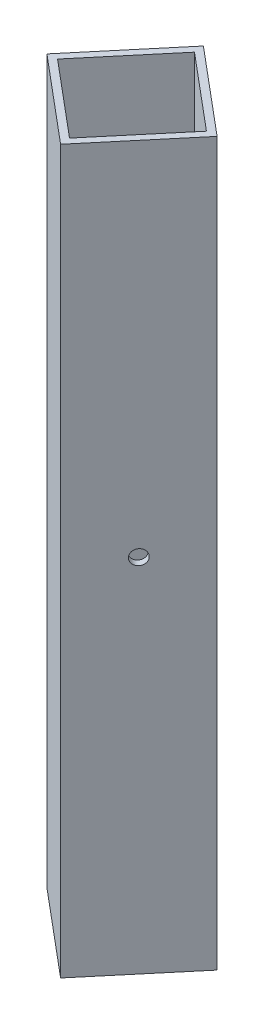
ISO-10303-21;
HEADER;
FILE_DESCRIPTION(('STEP AP214'),'2;1');
FILE_NAME('part.step','',(''),(''),'','','');
FILE_SCHEMA(('AUTOMOTIVE_DESIGN { 1 0 10303 214 1 1 1 1 }'));
ENDSEC;
DATA;
#1=APPLICATION_CONTEXT('core data for automotive mechanical design processes');
#2=APPLICATION_PROTOCOL_DEFINITION('international standard','automotive_design',2000,#1);
#3=PRODUCT_CONTEXT('',#1,'mechanical');
#4=PRODUCT('Part','Part','',(#3));
#5=PRODUCT_RELATED_PRODUCT_CATEGORY('part','',(#4));
#6=PRODUCT_DEFINITION_FORMATION('','',#4);
#7=PRODUCT_DEFINITION_CONTEXT('part definition',#1,'design');
#8=PRODUCT_DEFINITION('design','',#6,#7);
#9=PRODUCT_DEFINITION_SHAPE('','',#8);
#10=(LENGTH_UNIT() NAMED_UNIT(*) SI_UNIT(.MILLI.,.METRE.));
#11=(NAMED_UNIT(*) PLANE_ANGLE_UNIT() SI_UNIT($,.RADIAN.));
#12=(NAMED_UNIT(*) SI_UNIT($,.STERADIAN.) SOLID_ANGLE_UNIT());
#13=UNCERTAINTY_MEASURE_WITH_UNIT(LENGTH_MEASURE(1.E-05),#10,'distance_accuracy_value','');
#14=(GEOMETRIC_REPRESENTATION_CONTEXT(3) GLOBAL_UNCERTAINTY_ASSIGNED_CONTEXT((#13)) GLOBAL_UNIT_ASSIGNED_CONTEXT((#10,
#11,#12)) REPRESENTATION_CONTEXT('',''));
#15=CARTESIAN_POINT('',(0.,0.,0.));
#16=DIRECTION('',(0.,0.,1.));
#17=DIRECTION('',(1.,0.,0.));
#18=AXIS2_PLACEMENT_3D('',#15,#16,#17);
#19=CARTESIAN_POINT('',(360.587988116179,165.1,295.999551887389));
#20=DIRECTION('',(0.64278760968654,0.,-0.766044443118978));
#21=DIRECTION('',(-0.766044443118978,0.,-0.64278760968654));
#22=AXIS2_PLACEMENT_3D('',#19,#20,#21);
#23=PLANE('',#22);
#24=DIRECTION('',(0.766044443118978,0.,0.64278760968654));
#25=VECTOR('',#24,1.);
#26=CARTESIAN_POINT('',(360.587988116179,-165.1,295.999551887389));
#27=LINE('',#26,#25);
#28=CARTESIAN_POINT('',(987.787862844886,-165.1,822.282735446684));
#29=VERTEX_POINT('',#28);
#30=CARTESIAN_POINT('',(1026.70292055533,-165.1,854.93634601876));
#31=VERTEX_POINT('',#30);
#32=EDGE_CURVE('E163',#29,#31,#27,.T.);
#33=ORIENTED_EDGE('',*,*,#32,.F.);
#34=DIRECTION('',(0.,-1.,0.));
#35=VECTOR('',#34,1.);
#36=CARTESIAN_POINT('',(987.787862844886,165.1,822.282735446684));
#37=LINE('',#36,#35);
#38=CARTESIAN_POINT('',(987.787862844886,165.1,822.282735446684));
#39=VERTEX_POINT('',#38);
#40=EDGE_CURVE('E11',#39,#29,#37,.T.);
#41=ORIENTED_EDGE('',*,*,#40,.F.);
#42=DIRECTION('',(0.766044443118978,0.,0.64278760968654));
#43=VECTOR('',#42,1.);
#44=CARTESIAN_POINT('',(360.587988116179,165.1,295.999551887389));
#45=LINE('',#44,#43);
#46=CARTESIAN_POINT('',(1026.70292055533,165.1,854.93634601876));
#47=VERTEX_POINT('',#46);
#48=EDGE_CURVE('E121',#39,#47,#45,.T.);
#49=ORIENTED_EDGE('',*,*,#48,.T.);
#50=DIRECTION('',(0.,-1.,0.));
#51=VECTOR('',#50,1.);
#52=CARTESIAN_POINT('',(1026.70292055533,165.1,854.93634601876));
#53=LINE('',#52,#51);
#54=EDGE_CURVE('E88',#47,#31,#53,.T.);
#55=ORIENTED_EDGE('',*,*,#54,.T.);
#56=EDGE_LOOP('',(#33,#41,#49,#55));
#57=FACE_BOUND('',#56,.T.);
#58=ADVANCED_FACE('F16',(#57),#23,.T.);
#59=CARTESIAN_POINT('',(965.570417164201,165.1,848.760456154906));
#60=DIRECTION('',(0.766044443118978,0.,0.64278760968654));
#61=DIRECTION('',(0.64278760968654,0.,-0.766044443118978));
#62=AXIS2_PLACEMENT_3D('',#59,#60,#61);
#63=PLANE('',#62);
#64=CARTESIAN_POINT('',(971.461057558848,0.,841.740264301906));
#65=DIRECTION('',(-0.766044443118978,0.,-0.64278760968654));
#66=DIRECTION('',(-0.64278760968654,0.,0.766044443118978));
#67=AXIS2_PLACEMENT_3D('',#64,#65,#66);
#68=CIRCLE('',#67,3.37820000000011);
#69=CARTESIAN_POINT('',(969.289592455805,0.,844.328115639651));
#70=VERTEX_POINT('',#69);
#71=EDGE_CURVE('E264',#70,#70,#68,.T.);
#72=ORIENTED_EDGE('',*,*,#71,.F.);
#73=EDGE_LOOP('',(#72));
#74=FACE_BOUND('',#73,.T.);
#75=DIRECTION('',(-0.64278760968654,0.,0.766044443118978));
#76=VECTOR('',#75,1.);
#77=CARTESIAN_POINT('',(965.570417164201,-165.1,848.760456154906));
#78=LINE('',#77,#76);
#79=CARTESIAN_POINT('',(955.134252272809,-165.1,861.197793157127));
#80=VERTEX_POINT('',#79);
#81=EDGE_CURVE('E128',#29,#80,#78,.T.);
#82=ORIENTED_EDGE('',*,*,#81,.T.);
#83=DIRECTION('',(0.,-1.,0.));
#84=VECTOR('',#83,1.);
#85=CARTESIAN_POINT('',(955.134252272809,165.1,861.197793157127));
#86=LINE('',#85,#84);
#87=CARTESIAN_POINT('',(955.134252272809,165.1,861.197793157127));
#88=VERTEX_POINT('',#87);
#89=EDGE_CURVE('E27',#88,#80,#86,.T.);
#90=ORIENTED_EDGE('',*,*,#89,.F.);
#91=DIRECTION('',(-0.64278760968654,0.,0.766044443118978));
#92=VECTOR('',#91,1.);
#93=CARTESIAN_POINT('',(965.570417164201,165.1,848.760456154906));
#94=LINE('',#93,#92);
#95=EDGE_CURVE('E116',#39,#88,#94,.T.);
#96=ORIENTED_EDGE('',*,*,#95,.F.);
#97=ORIENTED_EDGE('',*,*,#40,.T.);
#98=EDGE_LOOP('',(#82,#90,#96,#97));
#99=FACE_BOUND('',#98,.T.);
#100=ADVANCED_FACE('F126',(#74,#99),#63,.F.);
#101=CARTESIAN_POINT('',(278.112903575089,165.1,293.109429165724));
#102=DIRECTION('',(-0.64278760968654,0.,0.766044443118978));
#103=DIRECTION('',(0.766044443118978,0.,0.64278760968654));
#104=AXIS2_PLACEMENT_3D('',#101,#102,#103);
#105=PLANE('',#104);
#106=DIRECTION('',(-0.766044443118978,0.,-0.64278760968654));
#107=VECTOR('',#106,1.);
#108=CARTESIAN_POINT('',(278.112903575089,-165.1,293.109429165724));
#109=LINE('',#108,#107);
#110=CARTESIAN_POINT('',(994.049309983253,-165.1,893.851403729204));
#111=VERTEX_POINT('',#110);
#112=EDGE_CURVE('E169',#111,#80,#109,.T.);
#113=ORIENTED_EDGE('',*,*,#112,.F.);
#114=DIRECTION('',(0.,-1.,0.));
#115=VECTOR('',#114,1.);
#116=CARTESIAN_POINT('',(994.049309983253,165.1,893.851403729204));
#117=LINE('',#116,#115);
#118=CARTESIAN_POINT('',(994.049309983253,165.1,893.851403729204));
#119=VERTEX_POINT('',#118);
#120=EDGE_CURVE('E78',#119,#111,#117,.T.);
#121=ORIENTED_EDGE('',*,*,#120,.F.);
#122=DIRECTION('',(-0.766044443118978,0.,-0.64278760968654));
#123=VECTOR('',#122,1.);
#124=CARTESIAN_POINT('',(278.112903575089,165.1,293.109429165724));
#125=LINE('',#124,#123);
#126=EDGE_CURVE('E120',#119,#88,#125,.T.);
#127=ORIENTED_EDGE('',*,*,#126,.T.);
#128=ORIENTED_EDGE('',*,*,#89,.T.);
#129=EDGE_LOOP('',(#113,#121,#127,#128));
#130=FACE_BOUND('',#129,.T.);
#131=ADVANCED_FACE('F134',(#130),#105,.T.);
#132=CARTESIAN_POINT('',(1002.44079281438,165.1,878.911400767734));
#133=DIRECTION('',(-0.766044443118978,0.,-0.64278760968654));
#134=DIRECTION('',(-0.64278760968654,0.,0.766044443118978));
#135=AXIS2_PLACEMENT_3D('',#132,#133,#134);
#136=PLANE('',#135);
#137=CARTESIAN_POINT('',(1007.94392416239,0.,872.353024213227));
#138=DIRECTION('',(-0.766044443118978,0.,-0.64278760968654));
#139=DIRECTION('',(-0.64278760968654,0.,0.766044443118978));
#140=AXIS2_PLACEMENT_3D('',#137,#138,#139);
#141=CIRCLE('',#140,3.3782);
#142=CARTESIAN_POINT('',(1005.77245905935,0.,874.940875550972));
#143=VERTEX_POINT('',#142);
#144=EDGE_CURVE('E151',#143,#143,#141,.F.);
#145=ORIENTED_EDGE('',*,*,#144,.T.);
#146=EDGE_LOOP('',(#145));
#147=FACE_BOUND('',#146,.T.);
#148=DIRECTION('',(0.64278760968654,0.,-0.766044443118978));
#149=VECTOR('',#148,1.);
#150=CARTESIAN_POINT('',(1002.44079281438,-165.1,878.911400767734));
#151=LINE('',#150,#149);
#152=CARTESIAN_POINT('',(993.657969537106,-165.1,889.378361961546));
#153=VERTEX_POINT('',#152);
#154=CARTESIAN_POINT('',(1022.22987878767,-165.1,855.327686464908));
#155=VERTEX_POINT('',#154);
#156=EDGE_CURVE('E146',#153,#155,#151,.T.);
#157=ORIENTED_EDGE('',*,*,#156,.F.);
#158=DIRECTION('',(0.,-1.,0.));
#159=VECTOR('',#158,1.);
#160=CARTESIAN_POINT('',(993.657969537106,165.1,889.378361961546));
#161=LINE('',#160,#159);
#162=CARTESIAN_POINT('',(993.657969537106,165.1,889.378361961546));
#163=VERTEX_POINT('',#162);
#164=EDGE_CURVE('E98',#163,#153,#161,.T.);
#165=ORIENTED_EDGE('',*,*,#164,.F.);
#166=DIRECTION('',(0.64278760968654,0.,-0.766044443118978));
#167=VECTOR('',#166,1.);
#168=CARTESIAN_POINT('',(1002.44079281438,165.1,878.911400767734));
#169=LINE('',#168,#167);
#170=CARTESIAN_POINT('',(1022.22987878767,165.1,855.327686464908));
#171=VERTEX_POINT('',#170);
#172=EDGE_CURVE('E175',#163,#171,#169,.T.);
#173=ORIENTED_EDGE('',*,*,#172,.T.);
#174=DIRECTION('',(0.,-1.,0.));
#175=VECTOR('',#174,1.);
#176=CARTESIAN_POINT('',(1022.22987878767,165.1,855.327686464908));
#177=LINE('',#176,#175);
#178=EDGE_CURVE('E142',#171,#155,#177,.T.);
#179=ORIENTED_EDGE('',*,*,#178,.T.);
#180=EDGE_LOOP('',(#157,#165,#173,#179));
#181=FACE_BOUND('',#180,.T.);
#182=ADVANCED_FACE('F18',(#147,#181),#136,.T.);
#183=CARTESIAN_POINT('',(754.755398596091,165.1,688.915302797637));
#184=DIRECTION('',(0.64278760968654,0.,-0.766044443118978));
#185=DIRECTION('',(-0.766044443118978,0.,-0.64278760968654));
#186=AXIS2_PLACEMENT_3D('',#183,#184,#185);
#187=PLANE('',#186);
#188=DIRECTION('',(0.766044443118978,0.,0.64278760968654));
#189=VECTOR('',#188,1.);
#190=CARTESIAN_POINT('',(754.755398596091,-165.1,688.915302797637));
#191=LINE('',#190,#189);
#192=CARTESIAN_POINT('',(959.607294040467,-165.1,860.80645271098));
#193=VERTEX_POINT('',#192);
#194=EDGE_CURVE('E150',#193,#153,#191,.T.);
#195=ORIENTED_EDGE('',*,*,#194,.F.);
#196=DIRECTION('',(0.,-1.,0.));
#197=VECTOR('',#196,1.);
#198=CARTESIAN_POINT('',(959.607294040467,165.1,860.80645271098));
#199=LINE('',#198,#197);
#200=CARTESIAN_POINT('',(959.607294040467,165.1,860.80645271098));
#201=VERTEX_POINT('',#200);
#202=EDGE_CURVE('E185',#201,#193,#199,.T.);
#203=ORIENTED_EDGE('',*,*,#202,.F.);
#204=DIRECTION('',(0.766044443118978,0.,0.64278760968654));
#205=VECTOR('',#204,1.);
#206=CARTESIAN_POINT('',(754.755398596091,165.1,688.915302797637));
#207=LINE('',#206,#205);
#208=EDGE_CURVE('E194',#201,#163,#207,.T.);
#209=ORIENTED_EDGE('',*,*,#208,.T.);
#210=ORIENTED_EDGE('',*,*,#164,.T.);
#211=EDGE_LOOP('',(#195,#203,#209,#210));
#212=FACE_BOUND('',#211,.T.);
#213=ADVANCED_FACE('F192',(#212),#187,.T.);
#214=CARTESIAN_POINT('',(968.002608271104,165.1,850.80130681566));
#215=DIRECTION('',(0.766044443118978,0.,0.64278760968654));
#216=DIRECTION('',(0.64278760968654,0.,-0.766044443118978));
#217=AXIS2_PLACEMENT_3D('',#214,#215,#216);
#218=PLANE('',#217);
#219=CARTESIAN_POINT('',(973.89324866575,0.,843.78111496266));
#220=DIRECTION('',(0.766044443118978,0.,0.64278760968654));
#221=DIRECTION('',(0.64278760968654,0.,-0.766044443118978));
#222=AXIS2_PLACEMENT_3D('',#219,#220,#221);
#223=CIRCLE('',#222,3.3782);
#224=CARTESIAN_POINT('',(976.064713768793,0.,841.193263624915));
#225=VERTEX_POINT('',#224);
#226=EDGE_CURVE('E257',#225,#225,#223,.F.);
#227=ORIENTED_EDGE('',*,*,#226,.T.);
#228=EDGE_LOOP('',(#227));
#229=FACE_BOUND('',#228,.T.);
#230=DIRECTION('',(-0.64278760968654,0.,0.766044443118978));
#231=VECTOR('',#230,1.);
#232=CARTESIAN_POINT('',(968.002608271104,-165.1,850.80130681566));
#233=LINE('',#232,#231);
#234=CARTESIAN_POINT('',(988.179203291034,-165.1,826.755777214341));
#235=VERTEX_POINT('',#234);
#236=EDGE_CURVE('E155',#235,#193,#233,.T.);
#237=ORIENTED_EDGE('',*,*,#236,.F.);
#238=DIRECTION('',(0.,-1.,0.));
#239=VECTOR('',#238,1.);
#240=CARTESIAN_POINT('',(988.179203291034,165.1,826.755777214341));
#241=LINE('',#240,#239);
#242=CARTESIAN_POINT('',(988.179203291034,165.1,826.755777214341));
#243=VERTEX_POINT('',#242);
#244=EDGE_CURVE('E182',#243,#235,#241,.T.);
#245=ORIENTED_EDGE('',*,*,#244,.F.);
#246=DIRECTION('',(-0.64278760968654,0.,0.766044443118978));
#247=VECTOR('',#246,1.);
#248=CARTESIAN_POINT('',(968.002608271104,165.1,850.80130681566));
#249=LINE('',#248,#247);
#250=EDGE_CURVE('E204',#243,#201,#249,.T.);
#251=ORIENTED_EDGE('',*,*,#250,.T.);
#252=ORIENTED_EDGE('',*,*,#202,.T.);
#253=EDGE_LOOP('',(#237,#245,#251,#252));
#254=FACE_BOUND('',#253,.T.);
#255=ADVANCED_FACE('F201',(#229,#254),#218,.T.);
#256=CARTESIAN_POINT('',(783.331583493842,165.1,654.868214994973));
#257=DIRECTION('',(-0.64278760968654,0.,0.766044443118978));
#258=DIRECTION('',(0.766044443118978,0.,0.64278760968654));
#259=AXIS2_PLACEMENT_3D('',#256,#257,#258);
#260=PLANE('',#259);
#261=DIRECTION('',(-0.766044443118978,0.,-0.64278760968654));
#262=VECTOR('',#261,1.);
#263=CARTESIAN_POINT('',(783.331583493842,-165.1,654.868214994973));
#264=LINE('',#263,#262);
#265=EDGE_CURVE('E159',#155,#235,#264,.T.);
#266=ORIENTED_EDGE('',*,*,#265,.F.);
#267=ORIENTED_EDGE('',*,*,#178,.F.);
#268=DIRECTION('',(-0.766044443118978,0.,-0.64278760968654));
#269=VECTOR('',#268,1.);
#270=CARTESIAN_POINT('',(783.331583493842,165.1,654.868214994973));
#271=LINE('',#270,#269);
#272=EDGE_CURVE('E211',#171,#243,#271,.T.);
#273=ORIENTED_EDGE('',*,*,#272,.T.);
#274=ORIENTED_EDGE('',*,*,#244,.T.);
#275=EDGE_LOOP('',(#266,#267,#273,#274));
#276=FACE_BOUND('',#275,.T.);
#277=ADVANCED_FACE('F221',(#276),#260,.T.);
#278=CARTESIAN_POINT('',(1004.87298392128,165.1,880.952251428489));
#279=DIRECTION('',(-0.766044443118978,0.,-0.64278760968654));
#280=DIRECTION('',(-0.64278760968654,0.,0.766044443118978));
#281=AXIS2_PLACEMENT_3D('',#278,#279,#280);
#282=PLANE('',#281);
#283=CARTESIAN_POINT('',(1010.37611526929,0.,874.393874873982));
#284=DIRECTION('',(-0.766044443118978,0.,-0.64278760968654));
#285=DIRECTION('',(-0.64278760968654,0.,0.766044443118978));
#286=AXIS2_PLACEMENT_3D('',#283,#284,#285);
#287=CIRCLE('',#286,3.3782);
#288=CARTESIAN_POINT('',(1008.20465016625,0.,876.981726211727));
#289=VERTEX_POINT('',#288);
#290=EDGE_CURVE('E20',#289,#289,#287,.F.);
#291=ORIENTED_EDGE('',*,*,#290,.F.);
#292=EDGE_LOOP('',(#291));
#293=FACE_BOUND('',#292,.T.);
#294=DIRECTION('',(0.64278760968654,0.,-0.766044443118978));
#295=VECTOR('',#294,1.);
#296=CARTESIAN_POINT('',(1004.87298392128,-165.1,880.952251428489));
#297=LINE('',#296,#295);
#298=EDGE_CURVE('E172',#111,#31,#297,.T.);
#299=ORIENTED_EDGE('',*,*,#298,.T.);
#300=ORIENTED_EDGE('',*,*,#54,.F.);
#301=DIRECTION('',(0.64278760968654,0.,-0.766044443118978));
#302=VECTOR('',#301,1.);
#303=CARTESIAN_POINT('',(1004.87298392128,165.1,880.952251428489));
#304=LINE('',#303,#302);
#305=EDGE_CURVE('E40',#119,#47,#304,.T.);
#306=ORIENTED_EDGE('',*,*,#305,.F.);
#307=ORIENTED_EDGE('',*,*,#120,.T.);
#308=EDGE_LOOP('',(#299,#300,#306,#307));
#309=FACE_BOUND('',#308,.T.);
#310=ADVANCED_FACE('F219',(#293,#309),#282,.F.);
#311=CARTESIAN_POINT('',(705.053366952356,165.1,637.655198226429));
#312=DIRECTION('',(0.,1.,0.));
#313=DIRECTION('',(-1.,0.,0.));
#314=AXIS2_PLACEMENT_3D('',#311,#312,#313);
#315=PLANE('',#314);
#316=ORIENTED_EDGE('',*,*,#172,.F.);
#317=ORIENTED_EDGE('',*,*,#208,.F.);
#318=ORIENTED_EDGE('',*,*,#250,.F.);
#319=ORIENTED_EDGE('',*,*,#272,.F.);
#320=EDGE_LOOP('',(#316,#317,#318,#319));
#321=FACE_BOUND('',#320,.T.);
#322=ORIENTED_EDGE('',*,*,#48,.F.);
#323=ORIENTED_EDGE('',*,*,#95,.T.);
#324=ORIENTED_EDGE('',*,*,#126,.F.);
#325=ORIENTED_EDGE('',*,*,#305,.T.);
#326=EDGE_LOOP('',(#322,#323,#324,#325));
#327=FACE_BOUND('',#326,.T.);
#328=ADVANCED_FACE('F118',(#321,#327),#315,.T.);
#329=CARTESIAN_POINT('',(705.053366952356,-165.1,637.655198226429));
#330=DIRECTION('',(0.,1.,0.));
#331=DIRECTION('',(-1.,0.,0.));
#332=AXIS2_PLACEMENT_3D('',#329,#330,#331);
#333=PLANE('',#332);
#334=ORIENTED_EDGE('',*,*,#156,.T.);
#335=ORIENTED_EDGE('',*,*,#265,.T.);
#336=ORIENTED_EDGE('',*,*,#236,.T.);
#337=ORIENTED_EDGE('',*,*,#194,.T.);
#338=EDGE_LOOP('',(#334,#335,#336,#337));
#339=FACE_BOUND('',#338,.T.);
#340=ORIENTED_EDGE('',*,*,#32,.T.);
#341=ORIENTED_EDGE('',*,*,#298,.F.);
#342=ORIENTED_EDGE('',*,*,#112,.T.);
#343=ORIENTED_EDGE('',*,*,#81,.F.);
#344=EDGE_LOOP('',(#340,#341,#342,#343));
#345=FACE_BOUND('',#344,.T.);
#346=ADVANCED_FACE('F197',(#339,#345),#333,.F.);
#347=CARTESIAN_POINT('',(1236.80258432085,0.,1064.38824154392));
#348=DIRECTION('',(-0.766044443118978,0.,-0.64278760968654));
#349=DIRECTION('',(-0.64278760968654,0.,0.766044443118978));
#350=AXIS2_PLACEMENT_3D('',#347,#348,#349);
#351=CYLINDRICAL_SURFACE('',#350,3.3782);
#352=ORIENTED_EDGE('',*,*,#144,.F.);
#353=EDGE_LOOP('',(#352));
#354=FACE_BOUND('',#353,.T.);
#355=ORIENTED_EDGE('',*,*,#290,.T.);
#356=EDGE_LOOP('',(#355));
#357=FACE_BOUND('',#356,.T.);
#358=ADVANCED_FACE('F273',(#354,#357),#351,.F.);
#359=ORIENTED_EDGE('',*,*,#226,.F.);
#360=EDGE_LOOP('',(#359));
#361=FACE_BOUND('',#360,.T.);
#362=ORIENTED_EDGE('',*,*,#71,.T.);
#363=EDGE_LOOP('',(#362));
#364=FACE_BOUND('',#363,.T.);
#365=ADVANCED_FACE('F275',(#361,#364),#351,.F.);
#366=CLOSED_SHELL('',(#58,#100,#131,#182,#213,#255,#277,#310,#328,#346,#358,#365));
#367=MANIFOLD_SOLID_BREP('B1',#366);
#368=ADVANCED_BREP_SHAPE_REPRESENTATION('',(#18,#367),#14);
#369=SHAPE_DEFINITION_REPRESENTATION(#9,#368);
ENDSEC;
END-ISO-10303-21;
